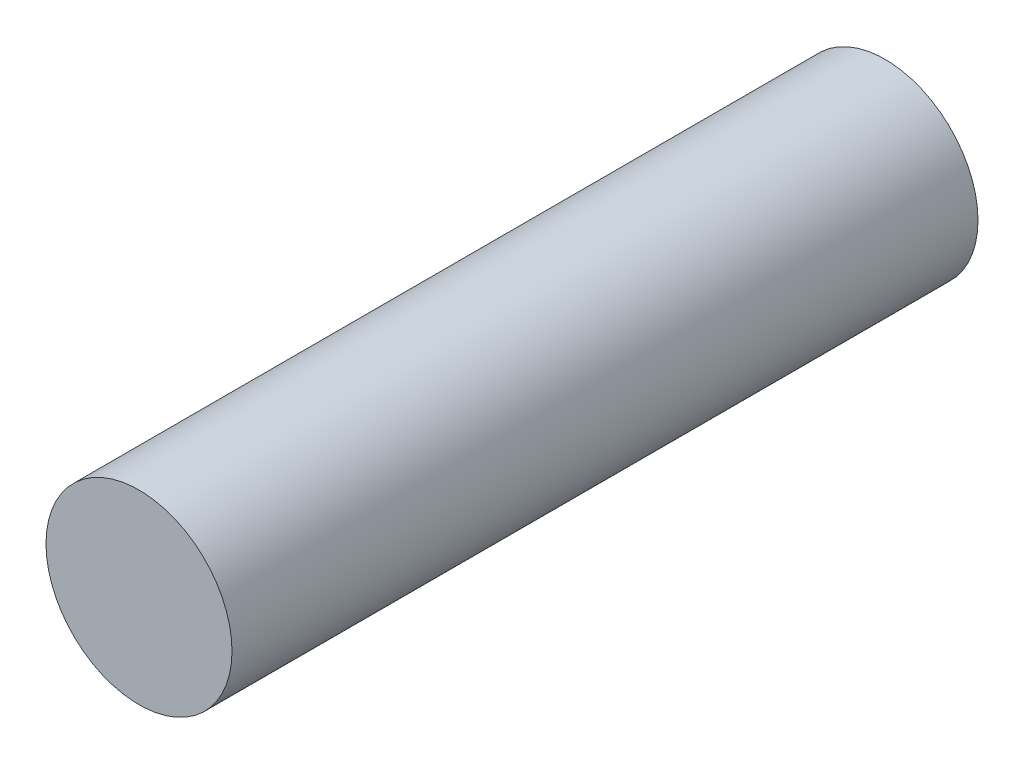
ISO-10303-21;
HEADER;
FILE_DESCRIPTION(('STEP AP214'),'2;1');
FILE_NAME('part.step','',(''),(''),'','','');
FILE_SCHEMA(('AUTOMOTIVE_DESIGN { 1 0 10303 214 1 1 1 1 }'));
ENDSEC;
DATA;
#1=APPLICATION_CONTEXT('core data for automotive mechanical design processes');
#2=APPLICATION_PROTOCOL_DEFINITION('international standard','automotive_design',2000,#1);
#3=PRODUCT_CONTEXT('',#1,'mechanical');
#4=PRODUCT('Part','Part','',(#3));
#5=PRODUCT_RELATED_PRODUCT_CATEGORY('part','',(#4));
#6=PRODUCT_DEFINITION_FORMATION('','',#4);
#7=PRODUCT_DEFINITION_CONTEXT('part definition',#1,'design');
#8=PRODUCT_DEFINITION('design','',#6,#7);
#9=PRODUCT_DEFINITION_SHAPE('','',#8);
#10=(LENGTH_UNIT() NAMED_UNIT(*) SI_UNIT(.MILLI.,.METRE.));
#11=(NAMED_UNIT(*) PLANE_ANGLE_UNIT() SI_UNIT($,.RADIAN.));
#12=(NAMED_UNIT(*) SI_UNIT($,.STERADIAN.) SOLID_ANGLE_UNIT());
#13=UNCERTAINTY_MEASURE_WITH_UNIT(LENGTH_MEASURE(1.E-05),#10,'distance_accuracy_value','');
#14=(GEOMETRIC_REPRESENTATION_CONTEXT(3) GLOBAL_UNCERTAINTY_ASSIGNED_CONTEXT((#13)) GLOBAL_UNIT_ASSIGNED_CONTEXT((#10,
#11,#12)) REPRESENTATION_CONTEXT('',''));
#15=CARTESIAN_POINT('',(0.,0.,0.));
#16=DIRECTION('',(0.,0.,1.));
#17=DIRECTION('',(1.,0.,0.));
#18=AXIS2_PLACEMENT_3D('',#15,#16,#17);
#19=CARTESIAN_POINT('',(0.,0.,7.5));
#20=DIRECTION('',(0.,0.,-1.));
#21=DIRECTION('',(-1.,0.,0.));
#22=AXIS2_PLACEMENT_3D('',#19,#20,#21);
#23=CYLINDRICAL_SURFACE('',#22,0.935);
#24=CARTESIAN_POINT('',(0.,0.,7.5));
#25=DIRECTION('',(0.,0.,1.));
#26=DIRECTION('',(1.,0.,0.));
#27=AXIS2_PLACEMENT_3D('',#24,#25,#26);
#28=CIRCLE('',#27,0.935);
#29=CARTESIAN_POINT('',(0.935,0.,7.5));
#30=VERTEX_POINT('',#29);
#31=EDGE_CURVE('E10',#30,#30,#28,.T.);
#32=ORIENTED_EDGE('',*,*,#31,.F.);
#33=EDGE_LOOP('',(#32));
#34=FACE_BOUND('',#33,.T.);
#35=CARTESIAN_POINT('',(0.,0.,0.));
#36=DIRECTION('',(0.,0.,1.));
#37=DIRECTION('',(1.,0.,0.));
#38=AXIS2_PLACEMENT_3D('',#35,#36,#37);
#39=CIRCLE('',#38,0.935);
#40=CARTESIAN_POINT('',(0.935,0.,0.));
#41=VERTEX_POINT('',#40);
#42=EDGE_CURVE('E40',#41,#41,#39,.T.);
#43=ORIENTED_EDGE('',*,*,#42,.T.);
#44=EDGE_LOOP('',(#43));
#45=FACE_BOUND('',#44,.T.);
#46=ADVANCED_FACE('F37',(#34,#45),#23,.T.);
#47=CARTESIAN_POINT('',(0.,0.,7.5));
#48=DIRECTION('',(0.,0.,1.));
#49=DIRECTION('',(1.,0.,0.));
#50=AXIS2_PLACEMENT_3D('',#47,#48,#49);
#51=PLANE('',#50);
#52=ORIENTED_EDGE('',*,*,#31,.T.);
#53=EDGE_LOOP('',(#52));
#54=FACE_BOUND('',#53,.T.);
#55=ADVANCED_FACE('F54',(#54),#51,.T.);
#56=CARTESIAN_POINT('',(0.,0.,0.));
#57=DIRECTION('',(0.,0.,1.));
#58=DIRECTION('',(1.,0.,0.));
#59=AXIS2_PLACEMENT_3D('',#56,#57,#58);
#60=PLANE('',#59);
#61=ORIENTED_EDGE('',*,*,#42,.F.);
#62=EDGE_LOOP('',(#61));
#63=FACE_BOUND('',#62,.T.);
#64=ADVANCED_FACE('F52',(#63),#60,.F.);
#65=CLOSED_SHELL('',(#46,#55,#64));
#66=MANIFOLD_SOLID_BREP('B2',#65);
#67=ADVANCED_BREP_SHAPE_REPRESENTATION('',(#18,#66),#14);
#68=SHAPE_DEFINITION_REPRESENTATION(#9,#67);
ENDSEC;
END-ISO-10303-21;
